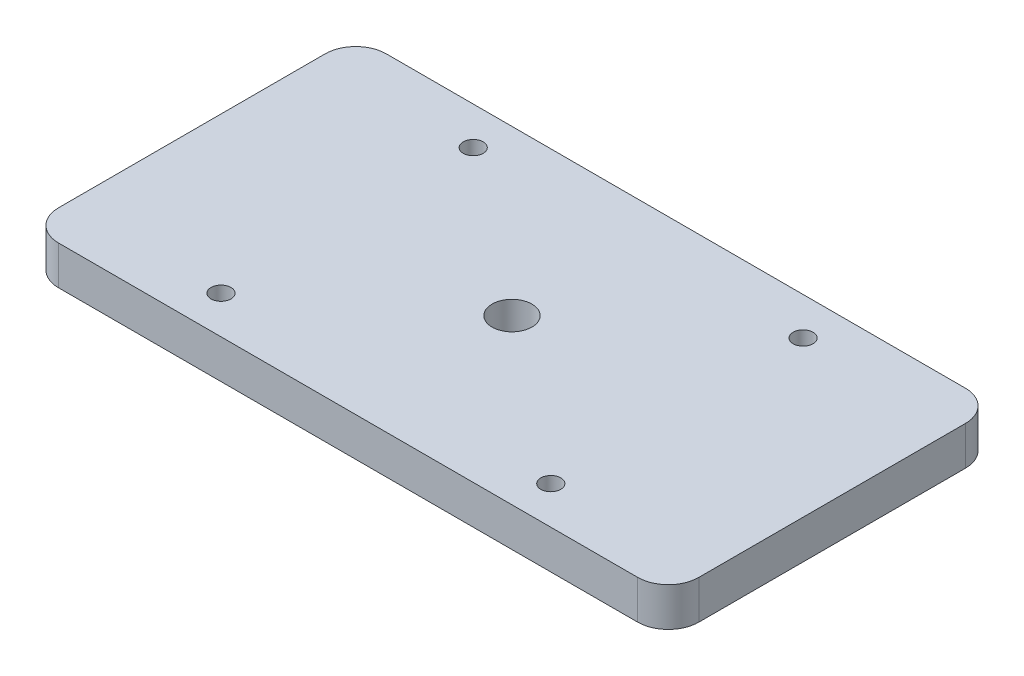
ISO-10303-21;
HEADER;
FILE_DESCRIPTION(('STEP AP214'),'2;1');
FILE_NAME('part.step','',(''),(''),'','','');
FILE_SCHEMA(('AUTOMOTIVE_DESIGN { 1 0 10303 214 1 1 1 1 }'));
ENDSEC;
DATA;
#1=APPLICATION_CONTEXT('core data for automotive mechanical design processes');
#2=APPLICATION_PROTOCOL_DEFINITION('international standard','automotive_design',2000,#1);
#3=PRODUCT_CONTEXT('',#1,'mechanical');
#4=PRODUCT('Part','Part','',(#3));
#5=PRODUCT_RELATED_PRODUCT_CATEGORY('part','',(#4));
#6=PRODUCT_DEFINITION_FORMATION('','',#4);
#7=PRODUCT_DEFINITION_CONTEXT('part definition',#1,'design');
#8=PRODUCT_DEFINITION('design','',#6,#7);
#9=PRODUCT_DEFINITION_SHAPE('','',#8);
#10=(LENGTH_UNIT() NAMED_UNIT(*) SI_UNIT(.MILLI.,.METRE.));
#11=(NAMED_UNIT(*) PLANE_ANGLE_UNIT() SI_UNIT($,.RADIAN.));
#12=(NAMED_UNIT(*) SI_UNIT($,.STERADIAN.) SOLID_ANGLE_UNIT());
#13=UNCERTAINTY_MEASURE_WITH_UNIT(LENGTH_MEASURE(1.E-05),#10,'distance_accuracy_value','');
#14=(GEOMETRIC_REPRESENTATION_CONTEXT(3) GLOBAL_UNCERTAINTY_ASSIGNED_CONTEXT((#13)) GLOBAL_UNIT_ASSIGNED_CONTEXT((#10,
#11,#12)) REPRESENTATION_CONTEXT('',''));
#15=CARTESIAN_POINT('',(0.,0.,0.));
#16=DIRECTION('',(0.,0.,1.));
#17=DIRECTION('',(1.,0.,0.));
#18=AXIS2_PLACEMENT_3D('',#15,#16,#17);
#19=CARTESIAN_POINT('',(0.,0.,0.));
#20=DIRECTION('',(0.,1.,0.));
#21=DIRECTION('',(0.,0.,1.));
#22=AXIS2_PLACEMENT_3D('',#19,#20,#21);
#23=PLANE('',#22);
#24=CARTESIAN_POINT('',(25.4,0.,-6.17749999999967));
#25=DIRECTION('',(0.,-1.,0.));
#26=DIRECTION('',(0.,0.,-1.));
#27=AXIS2_PLACEMENT_3D('',#24,#25,#26);
#28=CIRCLE('',#27,1.63194999999999);
#29=CARTESIAN_POINT('',(25.4,0.,-7.80944999999966));
#30=VERTEX_POINT('',#29);
#31=EDGE_CURVE('E239',#30,#30,#28,.T.);
#32=ORIENTED_EDGE('',*,*,#31,.F.);
#33=EDGE_LOOP('',(#32));
#34=FACE_BOUND('',#33,.T.);
#35=CARTESIAN_POINT('',(25.4,0.,-47.4524999999996));
#36=DIRECTION('',(0.,-1.,0.));
#37=DIRECTION('',(0.,0.,-1.));
#38=AXIS2_PLACEMENT_3D('',#35,#36,#37);
#39=CIRCLE('',#38,1.63194999999999);
#40=CARTESIAN_POINT('',(25.4,0.,-49.0844499999995));
#41=VERTEX_POINT('',#40);
#42=EDGE_CURVE('E231',#41,#41,#39,.T.);
#43=ORIENTED_EDGE('',*,*,#42,.F.);
#44=EDGE_LOOP('',(#43));
#45=FACE_BOUND('',#44,.T.);
#46=CARTESIAN_POINT('',(79.3749999999999,0.,-47.4524999999998));
#47=DIRECTION('',(0.,-1.,0.));
#48=DIRECTION('',(0.,0.,-1.));
#49=AXIS2_PLACEMENT_3D('',#46,#47,#48);
#50=CIRCLE('',#49,1.63194999999999);
#51=CARTESIAN_POINT('',(79.3749999999999,0.,-49.0844499999998));
#52=VERTEX_POINT('',#51);
#53=EDGE_CURVE('E223',#52,#52,#50,.T.);
#54=ORIENTED_EDGE('',*,*,#53,.F.);
#55=EDGE_LOOP('',(#54));
#56=FACE_BOUND('',#55,.T.);
#57=CARTESIAN_POINT('',(52.385,0.,-26.815));
#58=DIRECTION('',(0.,-1.,0.));
#59=DIRECTION('',(0.,0.,-1.));
#60=AXIS2_PLACEMENT_3D('',#57,#58,#59);
#61=CIRCLE('',#60,3.2639);
#62=CARTESIAN_POINT('',(52.385,0.,-30.0789));
#63=VERTEX_POINT('',#62);
#64=EDGE_CURVE('E143',#63,#63,#61,.T.);
#65=ORIENTED_EDGE('',*,*,#64,.F.);
#66=EDGE_LOOP('',(#65));
#67=FACE_BOUND('',#66,.T.);
#68=DIRECTION('',(0.,0.,1.));
#69=VECTOR('',#68,1.);
#70=CARTESIAN_POINT('',(0.,0.,-53.63));
#71=LINE('',#70,#69);
#72=CARTESIAN_POINT('',(0.,0.,-48.63));
#73=VERTEX_POINT('',#72);
#74=CARTESIAN_POINT('',(0.,0.,-5.));
#75=VERTEX_POINT('',#74);
#76=EDGE_CURVE('E123',#73,#75,#71,.T.);
#77=ORIENTED_EDGE('',*,*,#76,.F.);
#78=CARTESIAN_POINT('',(5.,0.,-48.63));
#79=DIRECTION('',(0.,1.,0.));
#80=DIRECTION('',(0.,0.,1.));
#81=AXIS2_PLACEMENT_3D('',#78,#79,#80);
#82=CIRCLE('',#81,5.);
#83=CARTESIAN_POINT('',(5.,0.,-53.63));
#84=VERTEX_POINT('',#83);
#85=EDGE_CURVE('E105',#73,#84,#82,.F.);
#86=ORIENTED_EDGE('',*,*,#85,.T.);
#87=DIRECTION('',(-1.,0.,0.));
#88=VECTOR('',#87,1.);
#89=CARTESIAN_POINT('',(0.,0.,-53.63));
#90=LINE('',#89,#88);
#91=CARTESIAN_POINT('',(99.775,0.,-53.63));
#92=VERTEX_POINT('',#91);
#93=EDGE_CURVE('E151',#92,#84,#90,.T.);
#94=ORIENTED_EDGE('',*,*,#93,.F.);
#95=CARTESIAN_POINT('',(99.775,0.,-48.63));
#96=DIRECTION('',(0.,1.,0.));
#97=DIRECTION('',(0.,0.,1.));
#98=AXIS2_PLACEMENT_3D('',#95,#96,#97);
#99=CIRCLE('',#98,5.);
#100=CARTESIAN_POINT('',(104.775,0.,-48.63));
#101=VERTEX_POINT('',#100);
#102=EDGE_CURVE('E158',#92,#101,#99,.F.);
#103=ORIENTED_EDGE('',*,*,#102,.T.);
#104=DIRECTION('',(0.,0.,-1.));
#105=VECTOR('',#104,1.);
#106=CARTESIAN_POINT('',(104.775,0.,-53.63));
#107=LINE('',#106,#105);
#108=CARTESIAN_POINT('',(104.775,0.,-5.));
#109=VERTEX_POINT('',#108);
#110=EDGE_CURVE('E140',#109,#101,#107,.T.);
#111=ORIENTED_EDGE('',*,*,#110,.F.);
#112=CARTESIAN_POINT('',(99.775,0.,-5.));
#113=DIRECTION('',(0.,1.,0.));
#114=DIRECTION('',(0.,0.,1.));
#115=AXIS2_PLACEMENT_3D('',#112,#113,#114);
#116=CIRCLE('',#115,5.);
#117=CARTESIAN_POINT('',(99.775,0.,0.));
#118=VERTEX_POINT('',#117);
#119=EDGE_CURVE('E128',#109,#118,#116,.F.);
#120=ORIENTED_EDGE('',*,*,#119,.T.);
#121=DIRECTION('',(1.,0.,0.));
#122=VECTOR('',#121,1.);
#123=CARTESIAN_POINT('',(0.,0.,0.));
#124=LINE('',#123,#122);
#125=CARTESIAN_POINT('',(5.,0.,0.));
#126=VERTEX_POINT('',#125);
#127=EDGE_CURVE('E134',#126,#118,#124,.T.);
#128=ORIENTED_EDGE('',*,*,#127,.F.);
#129=CARTESIAN_POINT('',(5.,0.,-5.));
#130=DIRECTION('',(0.,1.,0.));
#131=DIRECTION('',(0.,0.,1.));
#132=AXIS2_PLACEMENT_3D('',#129,#130,#131);
#133=CIRCLE('',#132,5.);
#134=EDGE_CURVE('E117',#126,#75,#133,.F.);
#135=ORIENTED_EDGE('',*,*,#134,.T.);
#136=EDGE_LOOP('',(#77,#86,#94,#103,#111,#120,#128,#135));
#137=FACE_BOUND('',#136,.T.);
#138=CARTESIAN_POINT('',(79.375,0.,-6.17749999999967));
#139=DIRECTION('',(0.,-1.,0.));
#140=DIRECTION('',(0.,0.,-1.));
#141=AXIS2_PLACEMENT_3D('',#138,#139,#140);
#142=CIRCLE('',#141,1.63194999999999);
#143=CARTESIAN_POINT('',(79.375,0.,-7.80944999999966));
#144=VERTEX_POINT('',#143);
#145=EDGE_CURVE('E215',#144,#144,#142,.T.);
#146=ORIENTED_EDGE('',*,*,#145,.F.);
#147=EDGE_LOOP('',(#146));
#148=FACE_BOUND('',#147,.T.);
#149=ADVANCED_FACE('F39',(#34,#45,#56,#67,#137,#148),#23,.F.);
#150=CARTESIAN_POINT('',(0.,6.35,-53.63));
#151=DIRECTION('',(1.,0.,0.));
#152=DIRECTION('',(0.,0.,-1.));
#153=AXIS2_PLACEMENT_3D('',#150,#151,#152);
#154=PLANE('',#153);
#155=DIRECTION('',(0.,0.,1.));
#156=VECTOR('',#155,1.);
#157=CARTESIAN_POINT('',(0.,6.35,-53.63));
#158=LINE('',#157,#156);
#159=CARTESIAN_POINT('',(0.,6.35,-48.63));
#160=VERTEX_POINT('',#159);
#161=CARTESIAN_POINT('',(0.,6.35,-5.));
#162=VERTEX_POINT('',#161);
#163=EDGE_CURVE('E126',#160,#162,#158,.T.);
#164=ORIENTED_EDGE('',*,*,#163,.F.);
#165=DIRECTION('',(0.,-1.,0.));
#166=VECTOR('',#165,1.);
#167=CARTESIAN_POINT('',(0.,6.35,-48.63));
#168=LINE('',#167,#166);
#169=EDGE_CURVE('E109',#160,#73,#168,.T.);
#170=ORIENTED_EDGE('',*,*,#169,.T.);
#171=ORIENTED_EDGE('',*,*,#76,.T.);
#172=DIRECTION('',(0.,-1.,0.));
#173=VECTOR('',#172,1.);
#174=CARTESIAN_POINT('',(0.,6.35,-5.));
#175=LINE('',#174,#173);
#176=EDGE_CURVE('E129',#75,#162,#175,.F.);
#177=ORIENTED_EDGE('',*,*,#176,.T.);
#178=EDGE_LOOP('',(#164,#170,#171,#177));
#179=FACE_BOUND('',#178,.T.);
#180=ADVANCED_FACE('F122',(#179),#154,.F.);
#181=CARTESIAN_POINT('',(0.,6.35,0.));
#182=DIRECTION('',(0.,0.,-1.));
#183=DIRECTION('',(-1.,0.,0.));
#184=AXIS2_PLACEMENT_3D('',#181,#182,#183);
#185=PLANE('',#184);
#186=DIRECTION('',(1.,0.,0.));
#187=VECTOR('',#186,1.);
#188=CARTESIAN_POINT('',(0.,6.35,0.));
#189=LINE('',#188,#187);
#190=CARTESIAN_POINT('',(5.,6.35,0.));
#191=VERTEX_POINT('',#190);
#192=CARTESIAN_POINT('',(99.775,6.35,0.));
#193=VERTEX_POINT('',#192);
#194=EDGE_CURVE('E202',#191,#193,#189,.T.);
#195=ORIENTED_EDGE('',*,*,#194,.F.);
#196=DIRECTION('',(0.,-1.,0.));
#197=VECTOR('',#196,1.);
#198=CARTESIAN_POINT('',(5.,6.35,0.));
#199=LINE('',#198,#197);
#200=EDGE_CURVE('E182',#191,#126,#199,.T.);
#201=ORIENTED_EDGE('',*,*,#200,.T.);
#202=ORIENTED_EDGE('',*,*,#127,.T.);
#203=DIRECTION('',(0.,-1.,0.));
#204=VECTOR('',#203,1.);
#205=CARTESIAN_POINT('',(99.775,6.35,0.));
#206=LINE('',#205,#204);
#207=EDGE_CURVE('E179',#118,#193,#206,.F.);
#208=ORIENTED_EDGE('',*,*,#207,.T.);
#209=EDGE_LOOP('',(#195,#201,#202,#208));
#210=FACE_BOUND('',#209,.T.);
#211=ADVANCED_FACE('F277',(#210),#185,.F.);
#212=CARTESIAN_POINT('',(104.775,6.35,-53.63));
#213=DIRECTION('',(-1.,0.,0.));
#214=DIRECTION('',(0.,0.,1.));
#215=AXIS2_PLACEMENT_3D('',#212,#213,#214);
#216=PLANE('',#215);
#217=ORIENTED_EDGE('',*,*,#110,.T.);
#218=DIRECTION('',(0.,-1.,0.));
#219=VECTOR('',#218,1.);
#220=CARTESIAN_POINT('',(104.775,6.35,-48.63));
#221=LINE('',#220,#219);
#222=CARTESIAN_POINT('',(104.775,6.35,-48.63));
#223=VERTEX_POINT('',#222);
#224=EDGE_CURVE('E11',#101,#223,#221,.F.);
#225=ORIENTED_EDGE('',*,*,#224,.T.);
#226=DIRECTION('',(0.,0.,-1.));
#227=VECTOR('',#226,1.);
#228=CARTESIAN_POINT('',(104.775,6.35,-53.63));
#229=LINE('',#228,#227);
#230=CARTESIAN_POINT('',(104.775,6.35,-5.));
#231=VERTEX_POINT('',#230);
#232=EDGE_CURVE('E190',#231,#223,#229,.T.);
#233=ORIENTED_EDGE('',*,*,#232,.F.);
#234=DIRECTION('',(0.,-1.,0.));
#235=VECTOR('',#234,1.);
#236=CARTESIAN_POINT('',(104.775,6.35,-5.));
#237=LINE('',#236,#235);
#238=EDGE_CURVE('E48',#231,#109,#237,.T.);
#239=ORIENTED_EDGE('',*,*,#238,.T.);
#240=EDGE_LOOP('',(#217,#225,#233,#239));
#241=FACE_BOUND('',#240,.T.);
#242=ADVANCED_FACE('F189',(#241),#216,.F.);
#243=CARTESIAN_POINT('',(0.,6.35,-53.63));
#244=DIRECTION('',(0.,0.,1.));
#245=DIRECTION('',(1.,0.,0.));
#246=AXIS2_PLACEMENT_3D('',#243,#244,#245);
#247=PLANE('',#246);
#248=ORIENTED_EDGE('',*,*,#93,.T.);
#249=DIRECTION('',(0.,-1.,0.));
#250=VECTOR('',#249,1.);
#251=CARTESIAN_POINT('',(5.,6.35,-53.63));
#252=LINE('',#251,#250);
#253=CARTESIAN_POINT('',(5.,6.35,-53.63));
#254=VERTEX_POINT('',#253);
#255=EDGE_CURVE('E110',#84,#254,#252,.F.);
#256=ORIENTED_EDGE('',*,*,#255,.T.);
#257=DIRECTION('',(-1.,0.,0.));
#258=VECTOR('',#257,1.);
#259=CARTESIAN_POINT('',(0.,6.35,-53.63));
#260=LINE('',#259,#258);
#261=CARTESIAN_POINT('',(99.775,6.35,-53.63));
#262=VERTEX_POINT('',#261);
#263=EDGE_CURVE('E146',#262,#254,#260,.T.);
#264=ORIENTED_EDGE('',*,*,#263,.F.);
#265=DIRECTION('',(0.,-1.,0.));
#266=VECTOR('',#265,1.);
#267=CARTESIAN_POINT('',(99.775,6.35,-53.63));
#268=LINE('',#267,#266);
#269=EDGE_CURVE('E116',#262,#92,#268,.T.);
#270=ORIENTED_EDGE('',*,*,#269,.T.);
#271=EDGE_LOOP('',(#248,#256,#264,#270));
#272=FACE_BOUND('',#271,.T.);
#273=ADVANCED_FACE('F198',(#272),#247,.F.);
#274=CARTESIAN_POINT('',(0.,6.35,0.));
#275=DIRECTION('',(0.,1.,0.));
#276=DIRECTION('',(0.,0.,1.));
#277=AXIS2_PLACEMENT_3D('',#274,#275,#276);
#278=PLANE('',#277);
#279=CARTESIAN_POINT('',(25.4,6.34999999999999,-6.17749999999967));
#280=DIRECTION('',(0.,-1.,0.));
#281=DIRECTION('',(0.,0.,-1.));
#282=AXIS2_PLACEMENT_3D('',#279,#280,#281);
#283=CIRCLE('',#282,1.63194999999999);
#284=CARTESIAN_POINT('',(25.4,6.34999999999999,-7.80944999999966));
#285=VERTEX_POINT('',#284);
#286=EDGE_CURVE('E235',#285,#285,#283,.T.);
#287=ORIENTED_EDGE('',*,*,#286,.T.);
#288=EDGE_LOOP('',(#287));
#289=FACE_BOUND('',#288,.T.);
#290=CARTESIAN_POINT('',(25.4,6.34999999999999,-47.4524999999996));
#291=DIRECTION('',(0.,-1.,0.));
#292=DIRECTION('',(0.,0.,-1.));
#293=AXIS2_PLACEMENT_3D('',#290,#291,#292);
#294=CIRCLE('',#293,1.63194999999999);
#295=CARTESIAN_POINT('',(25.4,6.34999999999999,-49.0844499999995));
#296=VERTEX_POINT('',#295);
#297=EDGE_CURVE('E227',#296,#296,#294,.T.);
#298=ORIENTED_EDGE('',*,*,#297,.T.);
#299=EDGE_LOOP('',(#298));
#300=FACE_BOUND('',#299,.T.);
#301=CARTESIAN_POINT('',(79.3749999999999,6.34999999999999,-47.4524999999998));
#302=DIRECTION('',(0.,-1.,0.));
#303=DIRECTION('',(0.,0.,-1.));
#304=AXIS2_PLACEMENT_3D('',#301,#302,#303);
#305=CIRCLE('',#304,1.63194999999999);
#306=CARTESIAN_POINT('',(79.3749999999999,6.34999999999999,-49.0844499999998));
#307=VERTEX_POINT('',#306);
#308=EDGE_CURVE('E219',#307,#307,#305,.T.);
#309=ORIENTED_EDGE('',*,*,#308,.T.);
#310=EDGE_LOOP('',(#309));
#311=FACE_BOUND('',#310,.T.);
#312=CARTESIAN_POINT('',(79.375,6.34999999999999,-6.17749999999967));
#313=DIRECTION('',(0.,-1.,0.));
#314=DIRECTION('',(0.,0.,-1.));
#315=AXIS2_PLACEMENT_3D('',#312,#313,#314);
#316=CIRCLE('',#315,1.63194999999999);
#317=CARTESIAN_POINT('',(79.375,6.34999999999999,-7.80944999999966));
#318=VERTEX_POINT('',#317);
#319=EDGE_CURVE('E211',#318,#318,#316,.T.);
#320=ORIENTED_EDGE('',*,*,#319,.T.);
#321=EDGE_LOOP('',(#320));
#322=FACE_BOUND('',#321,.T.);
#323=CARTESIAN_POINT('',(52.385,6.35,-26.815));
#324=DIRECTION('',(0.,-1.,0.));
#325=DIRECTION('',(0.,0.,-1.));
#326=AXIS2_PLACEMENT_3D('',#323,#324,#325);
#327=CIRCLE('',#326,3.2639);
#328=CARTESIAN_POINT('',(52.385,6.35,-30.0789));
#329=VERTEX_POINT('',#328);
#330=EDGE_CURVE('E135',#329,#329,#327,.T.);
#331=ORIENTED_EDGE('',*,*,#330,.T.);
#332=EDGE_LOOP('',(#331));
#333=FACE_BOUND('',#332,.T.);
#334=ORIENTED_EDGE('',*,*,#263,.T.);
#335=CARTESIAN_POINT('',(5.,6.35,-48.63));
#336=DIRECTION('',(0.,1.,0.));
#337=DIRECTION('',(0.,0.,1.));
#338=AXIS2_PLACEMENT_3D('',#335,#336,#337);
#339=CIRCLE('',#338,5.);
#340=EDGE_CURVE('E176',#254,#160,#339,.T.);
#341=ORIENTED_EDGE('',*,*,#340,.T.);
#342=ORIENTED_EDGE('',*,*,#163,.T.);
#343=CARTESIAN_POINT('',(5.,6.35,-5.));
#344=DIRECTION('',(0.,1.,0.));
#345=DIRECTION('',(0.,0.,1.));
#346=AXIS2_PLACEMENT_3D('',#343,#344,#345);
#347=CIRCLE('',#346,5.);
#348=EDGE_CURVE('E173',#162,#191,#347,.T.);
#349=ORIENTED_EDGE('',*,*,#348,.T.);
#350=ORIENTED_EDGE('',*,*,#194,.T.);
#351=CARTESIAN_POINT('',(99.775,6.35,-5.));
#352=DIRECTION('',(0.,1.,0.));
#353=DIRECTION('',(0.,0.,1.));
#354=AXIS2_PLACEMENT_3D('',#351,#352,#353);
#355=CIRCLE('',#354,5.);
#356=EDGE_CURVE('E60',#193,#231,#355,.T.);
#357=ORIENTED_EDGE('',*,*,#356,.T.);
#358=ORIENTED_EDGE('',*,*,#232,.T.);
#359=CARTESIAN_POINT('',(99.775,6.35,-48.63));
#360=DIRECTION('',(0.,1.,0.));
#361=DIRECTION('',(0.,0.,1.));
#362=AXIS2_PLACEMENT_3D('',#359,#360,#361);
#363=CIRCLE('',#362,5.);
#364=EDGE_CURVE('E170',#223,#262,#363,.T.);
#365=ORIENTED_EDGE('',*,*,#364,.T.);
#366=EDGE_LOOP('',(#334,#341,#342,#349,#350,#357,#358,#365));
#367=FACE_BOUND('',#366,.T.);
#368=ADVANCED_FACE('F257',(#289,#300,#311,#322,#333,#367),#278,.T.);
#369=CARTESIAN_POINT('',(52.385,0.,-26.815));
#370=DIRECTION('',(0.,-1.,0.));
#371=DIRECTION('',(0.,0.,-1.));
#372=AXIS2_PLACEMENT_3D('',#369,#370,#371);
#373=CYLINDRICAL_SURFACE('',#372,3.2639);
#374=ORIENTED_EDGE('',*,*,#330,.F.);
#375=EDGE_LOOP('',(#374));
#376=FACE_BOUND('',#375,.T.);
#377=ORIENTED_EDGE('',*,*,#64,.T.);
#378=EDGE_LOOP('',(#377));
#379=FACE_BOUND('',#378,.T.);
#380=ADVANCED_FACE('F255',(#376,#379),#373,.F.);
#381=CARTESIAN_POINT('',(5.,6.35,-48.63));
#382=DIRECTION('',(0.,-1.,0.));
#383=DIRECTION('',(0.,0.,-1.));
#384=AXIS2_PLACEMENT_3D('',#381,#382,#383);
#385=CYLINDRICAL_SURFACE('',#384,5.);
#386=ORIENTED_EDGE('',*,*,#340,.F.);
#387=ORIENTED_EDGE('',*,*,#255,.F.);
#388=ORIENTED_EDGE('',*,*,#85,.F.);
#389=ORIENTED_EDGE('',*,*,#169,.F.);
#390=EDGE_LOOP('',(#386,#387,#388,#389));
#391=FACE_BOUND('',#390,.T.);
#392=ADVANCED_FACE('F108',(#391),#385,.T.);
#393=CARTESIAN_POINT('',(5.,6.35,-5.));
#394=DIRECTION('',(0.,-1.,0.));
#395=DIRECTION('',(0.,0.,-1.));
#396=AXIS2_PLACEMENT_3D('',#393,#394,#395);
#397=CYLINDRICAL_SURFACE('',#396,5.);
#398=ORIENTED_EDGE('',*,*,#348,.F.);
#399=ORIENTED_EDGE('',*,*,#176,.F.);
#400=ORIENTED_EDGE('',*,*,#134,.F.);
#401=ORIENTED_EDGE('',*,*,#200,.F.);
#402=EDGE_LOOP('',(#398,#399,#400,#401));
#403=FACE_BOUND('',#402,.T.);
#404=ADVANCED_FACE('F264',(#403),#397,.T.);
#405=CARTESIAN_POINT('',(99.775,6.35,-48.63));
#406=DIRECTION('',(0.,-1.,0.));
#407=DIRECTION('',(0.,0.,-1.));
#408=AXIS2_PLACEMENT_3D('',#405,#406,#407);
#409=CYLINDRICAL_SURFACE('',#408,5.);
#410=ORIENTED_EDGE('',*,*,#364,.F.);
#411=ORIENTED_EDGE('',*,*,#224,.F.);
#412=ORIENTED_EDGE('',*,*,#102,.F.);
#413=ORIENTED_EDGE('',*,*,#269,.F.);
#414=EDGE_LOOP('',(#410,#411,#412,#413));
#415=FACE_BOUND('',#414,.T.);
#416=ADVANCED_FACE('F195',(#415),#409,.T.);
#417=CARTESIAN_POINT('',(99.775,6.35,-5.));
#418=DIRECTION('',(0.,-1.,0.));
#419=DIRECTION('',(0.,0.,-1.));
#420=AXIS2_PLACEMENT_3D('',#417,#418,#419);
#421=CYLINDRICAL_SURFACE('',#420,5.);
#422=ORIENTED_EDGE('',*,*,#356,.F.);
#423=ORIENTED_EDGE('',*,*,#207,.F.);
#424=ORIENTED_EDGE('',*,*,#119,.F.);
#425=ORIENTED_EDGE('',*,*,#238,.F.);
#426=EDGE_LOOP('',(#422,#423,#424,#425));
#427=FACE_BOUND('',#426,.T.);
#428=ADVANCED_FACE('F41',(#427),#421,.T.);
#429=CARTESIAN_POINT('',(79.375,0.,-6.17749999999967));
#430=DIRECTION('',(0.,-1.,0.));
#431=DIRECTION('',(0.,0.,-1.));
#432=AXIS2_PLACEMENT_3D('',#429,#430,#431);
#433=CYLINDRICAL_SURFACE('',#432,1.63194999999999);
#434=ORIENTED_EDGE('',*,*,#319,.F.);
#435=EDGE_LOOP('',(#434));
#436=FACE_BOUND('',#435,.T.);
#437=ORIENTED_EDGE('',*,*,#145,.T.);
#438=EDGE_LOOP('',(#437));
#439=FACE_BOUND('',#438,.T.);
#440=ADVANCED_FACE('F270',(#436,#439),#433,.F.);
#441=CARTESIAN_POINT('',(79.3749999999999,0.,-47.4524999999998));
#442=DIRECTION('',(0.,-1.,0.));
#443=DIRECTION('',(0.,0.,-1.));
#444=AXIS2_PLACEMENT_3D('',#441,#442,#443);
#445=CYLINDRICAL_SURFACE('',#444,1.63194999999999);
#446=ORIENTED_EDGE('',*,*,#308,.F.);
#447=EDGE_LOOP('',(#446));
#448=FACE_BOUND('',#447,.T.);
#449=ORIENTED_EDGE('',*,*,#53,.T.);
#450=EDGE_LOOP('',(#449));
#451=FACE_BOUND('',#450,.T.);
#452=ADVANCED_FACE('F292',(#448,#451),#445,.F.);
#453=CARTESIAN_POINT('',(25.4,0.,-47.4524999999996));
#454=DIRECTION('',(0.,-1.,0.));
#455=DIRECTION('',(0.,0.,-1.));
#456=AXIS2_PLACEMENT_3D('',#453,#454,#455);
#457=CYLINDRICAL_SURFACE('',#456,1.63194999999999);
#458=ORIENTED_EDGE('',*,*,#297,.F.);
#459=EDGE_LOOP('',(#458));
#460=FACE_BOUND('',#459,.T.);
#461=ORIENTED_EDGE('',*,*,#42,.T.);
#462=EDGE_LOOP('',(#461));
#463=FACE_BOUND('',#462,.T.);
#464=ADVANCED_FACE('F301',(#460,#463),#457,.F.);
#465=CARTESIAN_POINT('',(25.4,0.,-6.17749999999967));
#466=DIRECTION('',(0.,-1.,0.));
#467=DIRECTION('',(0.,0.,-1.));
#468=AXIS2_PLACEMENT_3D('',#465,#466,#467);
#469=CYLINDRICAL_SURFACE('',#468,1.63194999999999);
#470=ORIENTED_EDGE('',*,*,#286,.F.);
#471=EDGE_LOOP('',(#470));
#472=FACE_BOUND('',#471,.T.);
#473=ORIENTED_EDGE('',*,*,#31,.T.);
#474=EDGE_LOOP('',(#473));
#475=FACE_BOUND('',#474,.T.);
#476=ADVANCED_FACE('F244',(#472,#475),#469,.F.);
#477=CLOSED_SHELL('',(#149,#180,#211,#242,#273,#368,#380,#392,#404,#416,#428,#440,#452,#464,#476));
#478=MANIFOLD_SOLID_BREP('B2',#477);
#479=ADVANCED_BREP_SHAPE_REPRESENTATION('',(#18,#478),#14);
#480=SHAPE_DEFINITION_REPRESENTATION(#9,#479);
ENDSEC;
END-ISO-10303-21;
